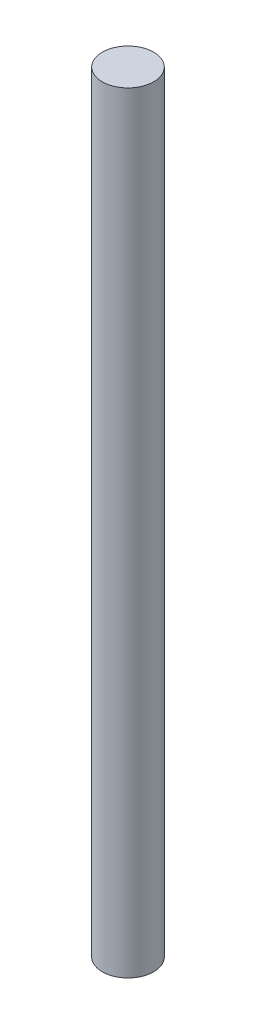
ISO-10303-21;
HEADER;
FILE_DESCRIPTION(('STEP AP214'),'2;1');
FILE_NAME('part.step','',(''),(''),'','','');
FILE_SCHEMA(('AUTOMOTIVE_DESIGN { 1 0 10303 214 1 1 1 1 }'));
ENDSEC;
DATA;
#1=APPLICATION_CONTEXT('core data for automotive mechanical design processes');
#2=APPLICATION_PROTOCOL_DEFINITION('international standard','automotive_design',2000,#1);
#3=PRODUCT_CONTEXT('',#1,'mechanical');
#4=PRODUCT('Part','Part','',(#3));
#5=PRODUCT_RELATED_PRODUCT_CATEGORY('part','',(#4));
#6=PRODUCT_DEFINITION_FORMATION('','',#4);
#7=PRODUCT_DEFINITION_CONTEXT('part definition',#1,'design');
#8=PRODUCT_DEFINITION('design','',#6,#7);
#9=PRODUCT_DEFINITION_SHAPE('','',#8);
#10=(LENGTH_UNIT() NAMED_UNIT(*) SI_UNIT(.MILLI.,.METRE.));
#11=(NAMED_UNIT(*) PLANE_ANGLE_UNIT() SI_UNIT($,.RADIAN.));
#12=(NAMED_UNIT(*) SI_UNIT($,.STERADIAN.) SOLID_ANGLE_UNIT());
#13=UNCERTAINTY_MEASURE_WITH_UNIT(LENGTH_MEASURE(1.E-05),#10,'distance_accuracy_value','');
#14=(GEOMETRIC_REPRESENTATION_CONTEXT(3) GLOBAL_UNCERTAINTY_ASSIGNED_CONTEXT((#13)) GLOBAL_UNIT_ASSIGNED_CONTEXT((#10,
#11,#12)) REPRESENTATION_CONTEXT('',''));
#15=CARTESIAN_POINT('',(0.,0.,0.));
#16=DIRECTION('',(0.,0.,1.));
#17=DIRECTION('',(1.,0.,0.));
#18=AXIS2_PLACEMENT_3D('',#15,#16,#17);
#19=CARTESIAN_POINT('',(0.,75.,0.));
#20=DIRECTION('',(0.,-1.,0.));
#21=DIRECTION('',(0.,0.,-1.));
#22=AXIS2_PLACEMENT_3D('',#19,#20,#21);
#23=CYLINDRICAL_SURFACE('',#22,2.5);
#24=CARTESIAN_POINT('',(0.,75.,0.));
#25=DIRECTION('',(0.,1.,0.));
#26=DIRECTION('',(0.,0.,1.));
#27=AXIS2_PLACEMENT_3D('',#24,#25,#26);
#28=CIRCLE('',#27,2.5);
#29=CARTESIAN_POINT('',(0.,75.,2.5));
#30=VERTEX_POINT('',#29);
#31=EDGE_CURVE('E10',#30,#30,#28,.T.);
#32=ORIENTED_EDGE('',*,*,#31,.F.);
#33=EDGE_LOOP('',(#32));
#34=FACE_BOUND('',#33,.T.);
#35=CARTESIAN_POINT('',(0.,0.,0.));
#36=DIRECTION('',(0.,1.,0.));
#37=DIRECTION('',(0.,0.,1.));
#38=AXIS2_PLACEMENT_3D('',#35,#36,#37);
#39=CIRCLE('',#38,2.5);
#40=CARTESIAN_POINT('',(0.,0.,2.5));
#41=VERTEX_POINT('',#40);
#42=EDGE_CURVE('E34',#41,#41,#39,.T.);
#43=ORIENTED_EDGE('',*,*,#42,.T.);
#44=EDGE_LOOP('',(#43));
#45=FACE_BOUND('',#44,.T.);
#46=ADVANCED_FACE('F31',(#34,#45),#23,.T.);
#47=CARTESIAN_POINT('',(0.,75.,0.));
#48=DIRECTION('',(0.,1.,0.));
#49=DIRECTION('',(0.,0.,1.));
#50=AXIS2_PLACEMENT_3D('',#47,#48,#49);
#51=PLANE('',#50);
#52=ORIENTED_EDGE('',*,*,#31,.T.);
#53=EDGE_LOOP('',(#52));
#54=FACE_BOUND('',#53,.T.);
#55=ADVANCED_FACE('F46',(#54),#51,.T.);
#56=CARTESIAN_POINT('',(0.,0.,0.));
#57=DIRECTION('',(0.,1.,0.));
#58=DIRECTION('',(0.,0.,1.));
#59=AXIS2_PLACEMENT_3D('',#56,#57,#58);
#60=PLANE('',#59);
#61=ORIENTED_EDGE('',*,*,#42,.F.);
#62=EDGE_LOOP('',(#61));
#63=FACE_BOUND('',#62,.T.);
#64=ADVANCED_FACE('F44',(#63),#60,.F.);
#65=CLOSED_SHELL('',(#46,#55,#64));
#66=MANIFOLD_SOLID_BREP('B2',#65);
#67=ADVANCED_BREP_SHAPE_REPRESENTATION('',(#18,#66),#14);
#68=SHAPE_DEFINITION_REPRESENTATION(#9,#67);
ENDSEC;
END-ISO-10303-21;
